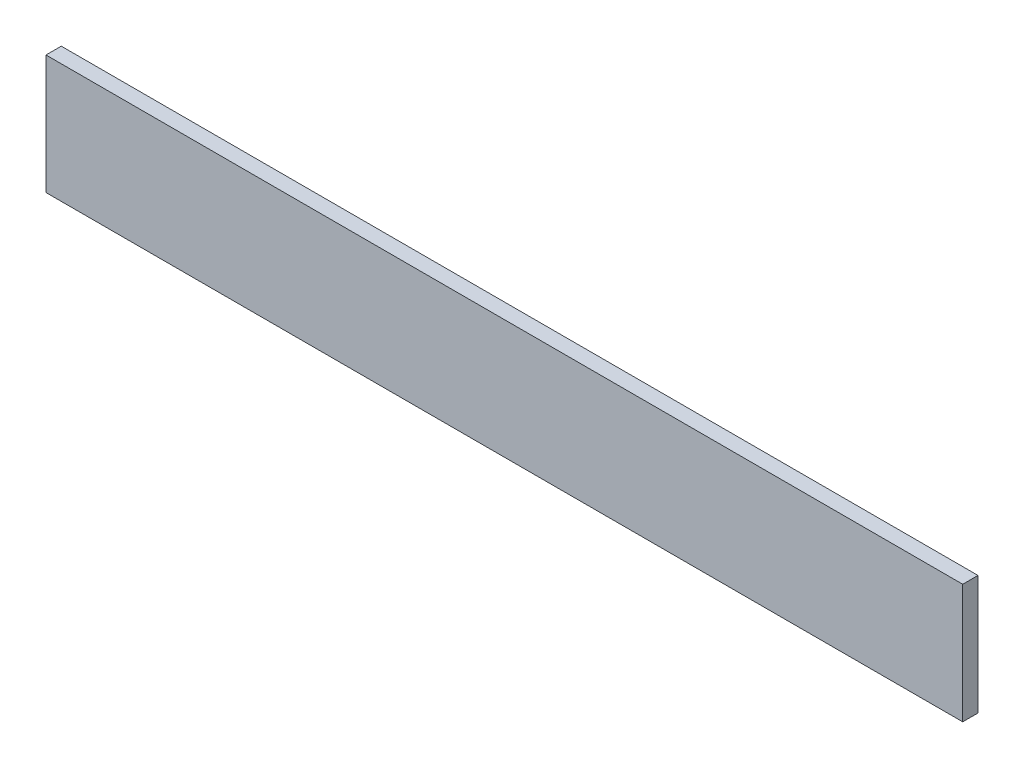
ISO-10303-21;
HEADER;
FILE_DESCRIPTION(('STEP AP214'),'2;1');
FILE_NAME('part.step','',(''),(''),'','','');
FILE_SCHEMA(('AUTOMOTIVE_DESIGN { 1 0 10303 214 1 1 1 1 }'));
ENDSEC;
DATA;
#1=APPLICATION_CONTEXT('core data for automotive mechanical design processes');
#2=APPLICATION_PROTOCOL_DEFINITION('international standard','automotive_design',2000,#1);
#3=PRODUCT_CONTEXT('',#1,'mechanical');
#4=PRODUCT('Part','Part','',(#3));
#5=PRODUCT_RELATED_PRODUCT_CATEGORY('part','',(#4));
#6=PRODUCT_DEFINITION_FORMATION('','',#4);
#7=PRODUCT_DEFINITION_CONTEXT('part definition',#1,'design');
#8=PRODUCT_DEFINITION('design','',#6,#7);
#9=PRODUCT_DEFINITION_SHAPE('','',#8);
#10=(LENGTH_UNIT() NAMED_UNIT(*) SI_UNIT(.MILLI.,.METRE.));
#11=(NAMED_UNIT(*) PLANE_ANGLE_UNIT() SI_UNIT($,.RADIAN.));
#12=(NAMED_UNIT(*) SI_UNIT($,.STERADIAN.) SOLID_ANGLE_UNIT());
#13=UNCERTAINTY_MEASURE_WITH_UNIT(LENGTH_MEASURE(1.E-05),#10,'distance_accuracy_value','');
#14=(GEOMETRIC_REPRESENTATION_CONTEXT(3) GLOBAL_UNCERTAINTY_ASSIGNED_CONTEXT((#13)) GLOBAL_UNIT_ASSIGNED_CONTEXT((#10,
#11,#12)) REPRESENTATION_CONTEXT('',''));
#15=CARTESIAN_POINT('',(0.,0.,0.));
#16=DIRECTION('',(0.,0.,1.));
#17=DIRECTION('',(1.,0.,0.));
#18=AXIS2_PLACEMENT_3D('',#15,#16,#17);
#19=CARTESIAN_POINT('',(0.,0.,10.));
#20=DIRECTION('',(1.,0.,0.));
#21=DIRECTION('',(0.,0.,-1.));
#22=AXIS2_PLACEMENT_3D('',#19,#20,#21);
#23=PLANE('',#22);
#24=DIRECTION('',(0.,-1.,0.));
#25=VECTOR('',#24,1.);
#26=CARTESIAN_POINT('',(0.,0.,0.));
#27=LINE('',#26,#25);
#28=CARTESIAN_POINT('',(0.,78.,0.));
#29=VERTEX_POINT('',#28);
#30=CARTESIAN_POINT('',(0.,0.,0.));
#31=VERTEX_POINT('',#30);
#32=EDGE_CURVE('E96',#29,#31,#27,.T.);
#33=ORIENTED_EDGE('',*,*,#32,.T.);
#34=DIRECTION('',(0.,0.,-1.));
#35=VECTOR('',#34,1.);
#36=CARTESIAN_POINT('',(0.,0.,10.));
#37=LINE('',#36,#35);
#38=CARTESIAN_POINT('',(0.,0.,10.));
#39=VERTEX_POINT('',#38);
#40=EDGE_CURVE('E11',#39,#31,#37,.T.);
#41=ORIENTED_EDGE('',*,*,#40,.F.);
#42=DIRECTION('',(0.,-1.,0.));
#43=VECTOR('',#42,1.);
#44=CARTESIAN_POINT('',(0.,0.,10.));
#45=LINE('',#44,#43);
#46=CARTESIAN_POINT('',(0.,78.,10.));
#47=VERTEX_POINT('',#46);
#48=EDGE_CURVE('E84',#47,#39,#45,.T.);
#49=ORIENTED_EDGE('',*,*,#48,.F.);
#50=DIRECTION('',(0.,0.,-1.));
#51=VECTOR('',#50,1.);
#52=CARTESIAN_POINT('',(0.,78.,10.));
#53=LINE('',#52,#51);
#54=EDGE_CURVE('E92',#47,#29,#53,.T.);
#55=ORIENTED_EDGE('',*,*,#54,.T.);
#56=EDGE_LOOP('',(#33,#41,#49,#55));
#57=FACE_BOUND('',#56,.T.);
#58=ADVANCED_FACE('F33',(#57),#23,.F.);
#59=CARTESIAN_POINT('',(0.,0.,10.));
#60=DIRECTION('',(0.,1.,0.));
#61=DIRECTION('',(0.,0.,1.));
#62=AXIS2_PLACEMENT_3D('',#59,#60,#61);
#63=PLANE('',#62);
#64=DIRECTION('',(1.,0.,0.));
#65=VECTOR('',#64,1.);
#66=CARTESIAN_POINT('',(0.,0.,0.));
#67=LINE('',#66,#65);
#68=CARTESIAN_POINT('',(600.,0.,0.));
#69=VERTEX_POINT('',#68);
#70=EDGE_CURVE('E88',#31,#69,#67,.T.);
#71=ORIENTED_EDGE('',*,*,#70,.T.);
#72=DIRECTION('',(0.,0.,-1.));
#73=VECTOR('',#72,1.);
#74=CARTESIAN_POINT('',(600.,0.,10.));
#75=LINE('',#74,#73);
#76=CARTESIAN_POINT('',(600.,0.,10.));
#77=VERTEX_POINT('',#76);
#78=EDGE_CURVE('E41',#77,#69,#75,.T.);
#79=ORIENTED_EDGE('',*,*,#78,.F.);
#80=DIRECTION('',(1.,0.,0.));
#81=VECTOR('',#80,1.);
#82=CARTESIAN_POINT('',(0.,0.,10.));
#83=LINE('',#82,#81);
#84=EDGE_CURVE('E79',#39,#77,#83,.T.);
#85=ORIENTED_EDGE('',*,*,#84,.F.);
#86=ORIENTED_EDGE('',*,*,#40,.T.);
#87=EDGE_LOOP('',(#71,#79,#85,#86));
#88=FACE_BOUND('',#87,.T.);
#89=ADVANCED_FACE('F87',(#88),#63,.F.);
#90=CARTESIAN_POINT('',(600.,0.,10.));
#91=DIRECTION('',(-1.,0.,0.));
#92=DIRECTION('',(0.,0.,1.));
#93=AXIS2_PLACEMENT_3D('',#90,#91,#92);
#94=PLANE('',#93);
#95=DIRECTION('',(0.,1.,0.));
#96=VECTOR('',#95,1.);
#97=CARTESIAN_POINT('',(600.,0.,0.));
#98=LINE('',#97,#96);
#99=CARTESIAN_POINT('',(600.,78.,0.));
#100=VERTEX_POINT('',#99);
#101=EDGE_CURVE('E66',#69,#100,#98,.T.);
#102=ORIENTED_EDGE('',*,*,#101,.T.);
#103=DIRECTION('',(0.,0.,-1.));
#104=VECTOR('',#103,1.);
#105=CARTESIAN_POINT('',(600.,78.,10.));
#106=LINE('',#105,#104);
#107=CARTESIAN_POINT('',(600.,78.,10.));
#108=VERTEX_POINT('',#107);
#109=EDGE_CURVE('E89',#108,#100,#106,.T.);
#110=ORIENTED_EDGE('',*,*,#109,.F.);
#111=DIRECTION('',(0.,1.,0.));
#112=VECTOR('',#111,1.);
#113=CARTESIAN_POINT('',(600.,0.,10.));
#114=LINE('',#113,#112);
#115=EDGE_CURVE('E82',#77,#108,#114,.T.);
#116=ORIENTED_EDGE('',*,*,#115,.F.);
#117=ORIENTED_EDGE('',*,*,#78,.T.);
#118=EDGE_LOOP('',(#102,#110,#116,#117));
#119=FACE_BOUND('',#118,.T.);
#120=ADVANCED_FACE('F90',(#119),#94,.F.);
#121=CARTESIAN_POINT('',(0.,78.,10.));
#122=DIRECTION('',(0.,-1.,0.));
#123=DIRECTION('',(0.,0.,-1.));
#124=AXIS2_PLACEMENT_3D('',#121,#122,#123);
#125=PLANE('',#124);
#126=DIRECTION('',(-1.,0.,0.));
#127=VECTOR('',#126,1.);
#128=CARTESIAN_POINT('',(0.,78.,0.));
#129=LINE('',#128,#127);
#130=EDGE_CURVE('E72',#100,#29,#129,.T.);
#131=ORIENTED_EDGE('',*,*,#130,.T.);
#132=ORIENTED_EDGE('',*,*,#54,.F.);
#133=DIRECTION('',(-1.,0.,0.));
#134=VECTOR('',#133,1.);
#135=CARTESIAN_POINT('',(0.,78.,10.));
#136=LINE('',#135,#134);
#137=EDGE_CURVE('E49',#108,#47,#136,.T.);
#138=ORIENTED_EDGE('',*,*,#137,.F.);
#139=ORIENTED_EDGE('',*,*,#109,.T.);
#140=EDGE_LOOP('',(#131,#132,#138,#139));
#141=FACE_BOUND('',#140,.T.);
#142=ADVANCED_FACE('F103',(#141),#125,.F.);
#143=CARTESIAN_POINT('',(0.,0.,10.));
#144=DIRECTION('',(0.,0.,-1.));
#145=DIRECTION('',(-1.,0.,0.));
#146=AXIS2_PLACEMENT_3D('',#143,#144,#145);
#147=PLANE('',#146);
#148=ORIENTED_EDGE('',*,*,#48,.T.);
#149=ORIENTED_EDGE('',*,*,#84,.T.);
#150=ORIENTED_EDGE('',*,*,#115,.T.);
#151=ORIENTED_EDGE('',*,*,#137,.T.);
#152=EDGE_LOOP('',(#148,#149,#150,#151));
#153=FACE_BOUND('',#152,.T.);
#154=ADVANCED_FACE('F80',(#153),#147,.F.);
#155=CARTESIAN_POINT('',(0.,0.,0.));
#156=DIRECTION('',(0.,0.,-1.));
#157=DIRECTION('',(-1.,0.,0.));
#158=AXIS2_PLACEMENT_3D('',#155,#156,#157);
#159=PLANE('',#158);
#160=ORIENTED_EDGE('',*,*,#32,.F.);
#161=ORIENTED_EDGE('',*,*,#130,.F.);
#162=ORIENTED_EDGE('',*,*,#101,.F.);
#163=ORIENTED_EDGE('',*,*,#70,.F.);
#164=EDGE_LOOP('',(#160,#161,#162,#163));
#165=FACE_BOUND('',#164,.T.);
#166=ADVANCED_FACE('F106',(#165),#159,.T.);
#167=CLOSED_SHELL('',(#58,#89,#120,#142,#154,#166));
#168=MANIFOLD_SOLID_BREP('B2',#167);
#169=ADVANCED_BREP_SHAPE_REPRESENTATION('',(#18,#168),#14);
#170=SHAPE_DEFINITION_REPRESENTATION(#9,#169);
ENDSEC;
END-ISO-10303-21;
